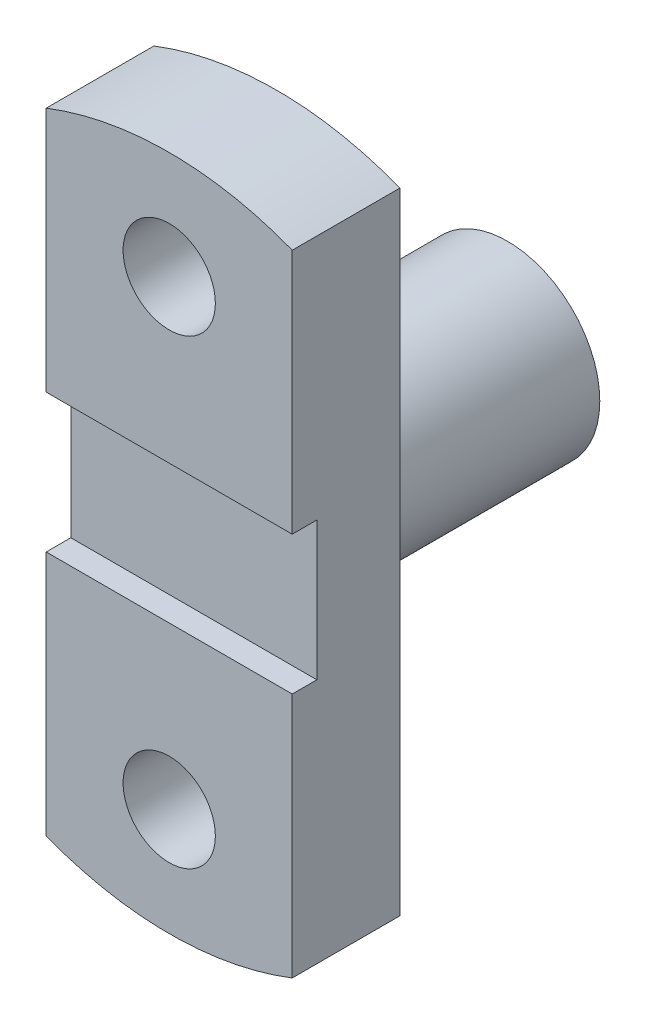
ISO-10303-21;
HEADER;
FILE_DESCRIPTION(('STEP AP214'),'2;1');
FILE_NAME('part.step','',(''),(''),'','','');
FILE_SCHEMA(('AUTOMOTIVE_DESIGN { 1 0 10303 214 1 1 1 1 }'));
ENDSEC;
DATA;
#1=APPLICATION_CONTEXT('core data for automotive mechanical design processes');
#2=APPLICATION_PROTOCOL_DEFINITION('international standard','automotive_design',2000,#1);
#3=PRODUCT_CONTEXT('',#1,'mechanical');
#4=PRODUCT('Part','Part','',(#3));
#5=PRODUCT_RELATED_PRODUCT_CATEGORY('part','',(#4));
#6=PRODUCT_DEFINITION_FORMATION('','',#4);
#7=PRODUCT_DEFINITION_CONTEXT('part definition',#1,'design');
#8=PRODUCT_DEFINITION('design','',#6,#7);
#9=PRODUCT_DEFINITION_SHAPE('','',#8);
#10=(LENGTH_UNIT() NAMED_UNIT(*) SI_UNIT(.MILLI.,.METRE.));
#11=(NAMED_UNIT(*) PLANE_ANGLE_UNIT() SI_UNIT($,.RADIAN.));
#12=(NAMED_UNIT(*) SI_UNIT($,.STERADIAN.) SOLID_ANGLE_UNIT());
#13=UNCERTAINTY_MEASURE_WITH_UNIT(LENGTH_MEASURE(1.E-05),#10,'distance_accuracy_value','');
#14=(GEOMETRIC_REPRESENTATION_CONTEXT(3) GLOBAL_UNCERTAINTY_ASSIGNED_CONTEXT((#13)) GLOBAL_UNIT_ASSIGNED_CONTEXT((#10,
#11,#12)) REPRESENTATION_CONTEXT('',''));
#15=CARTESIAN_POINT('',(0.,0.,0.));
#16=DIRECTION('',(0.,0.,1.));
#17=DIRECTION('',(1.,0.,0.));
#18=AXIS2_PLACEMENT_3D('',#15,#16,#17);
#19=CARTESIAN_POINT('',(0.,0.,110.));
#20=DIRECTION('',(0.,0.,1.));
#21=DIRECTION('',(1.,0.,0.));
#22=AXIS2_PLACEMENT_3D('',#19,#20,#21);
#23=PLANE('',#22);
#24=DIRECTION('',(1.,0.,0.));
#25=VECTOR('',#24,1.);
#26=CARTESIAN_POINT('',(-40.001,22.5,110.));
#27=LINE('',#26,#25);
#28=CARTESIAN_POINT('',(-40.,22.5,110.));
#29=VERTEX_POINT('',#28);
#30=CARTESIAN_POINT('',(40.,22.5,110.));
#31=VERTEX_POINT('',#30);
#32=EDGE_CURVE('E119',#29,#31,#27,.T.);
#33=ORIENTED_EDGE('',*,*,#32,.T.);
#34=DIRECTION('',(0.,1.,0.));
#35=VECTOR('',#34,1.);
#36=CARTESIAN_POINT('',(40.,-102.469507659596,110.));
#37=LINE('',#36,#35);
#38=CARTESIAN_POINT('',(40.,102.469507659596,110.));
#39=VERTEX_POINT('',#38);
#40=EDGE_CURVE('E202',#31,#39,#37,.T.);
#41=ORIENTED_EDGE('',*,*,#40,.T.);
#42=CARTESIAN_POINT('',(0.,0.,110.));
#43=DIRECTION('',(0.,0.,1.));
#44=DIRECTION('',(1.,0.,0.));
#45=AXIS2_PLACEMENT_3D('',#42,#43,#44);
#46=CIRCLE('',#45,110.);
#47=CARTESIAN_POINT('',(-40.,102.469507659596,110.));
#48=VERTEX_POINT('',#47);
#49=EDGE_CURVE('E129',#39,#48,#46,.T.);
#50=ORIENTED_EDGE('',*,*,#49,.T.);
#51=DIRECTION('',(0.,-1.,0.));
#52=VECTOR('',#51,1.);
#53=CARTESIAN_POINT('',(-40.,102.469507659596,110.));
#54=LINE('',#53,#52);
#55=EDGE_CURVE('E128',#48,#29,#54,.T.);
#56=ORIENTED_EDGE('',*,*,#55,.T.);
#57=EDGE_LOOP('',(#33,#41,#50,#56));
#58=FACE_BOUND('',#57,.T.);
#59=CARTESIAN_POINT('',(0.,75.,110.));
#60=DIRECTION('',(0.,0.,1.));
#61=DIRECTION('',(1.,0.,0.));
#62=AXIS2_PLACEMENT_3D('',#59,#60,#61);
#63=CIRCLE('',#62,15.);
#64=CARTESIAN_POINT('',(15.,75.,110.));
#65=VERTEX_POINT('',#64);
#66=EDGE_CURVE('E209',#65,#65,#63,.T.);
#67=ORIENTED_EDGE('',*,*,#66,.F.);
#68=EDGE_LOOP('',(#67));
#69=FACE_BOUND('',#68,.T.);
#70=ADVANCED_FACE('F37',(#58,#69),#23,.T.);
#71=CARTESIAN_POINT('',(0.,0.,75.));
#72=DIRECTION('',(0.,0.,-1.));
#73=DIRECTION('',(-1.,0.,0.));
#74=AXIS2_PLACEMENT_3D('',#71,#72,#73);
#75=CYLINDRICAL_SURFACE('',#74,30.);
#76=CARTESIAN_POINT('',(0.,0.,75.));
#77=DIRECTION('',(0.,0.,1.));
#78=DIRECTION('',(1.,0.,0.));
#79=AXIS2_PLACEMENT_3D('',#76,#77,#78);
#80=CIRCLE('',#79,30.);
#81=CARTESIAN_POINT('',(30.,0.,75.));
#82=VERTEX_POINT('',#81);
#83=EDGE_CURVE('E11',#82,#82,#80,.T.);
#84=ORIENTED_EDGE('',*,*,#83,.F.);
#85=EDGE_LOOP('',(#84));
#86=FACE_BOUND('',#85,.T.);
#87=CARTESIAN_POINT('',(0.,0.,0.));
#88=DIRECTION('',(0.,0.,1.));
#89=DIRECTION('',(1.,0.,0.));
#90=AXIS2_PLACEMENT_3D('',#87,#88,#89);
#91=CIRCLE('',#90,30.);
#92=CARTESIAN_POINT('',(30.,0.,0.));
#93=VERTEX_POINT('',#92);
#94=EDGE_CURVE('E41',#93,#93,#91,.T.);
#95=ORIENTED_EDGE('',*,*,#94,.T.);
#96=EDGE_LOOP('',(#95));
#97=FACE_BOUND('',#96,.T.);
#98=ADVANCED_FACE('F39',(#86,#97),#75,.T.);
#99=CARTESIAN_POINT('',(0.,0.,0.));
#100=DIRECTION('',(0.,0.,1.));
#101=DIRECTION('',(1.,0.,0.));
#102=AXIS2_PLACEMENT_3D('',#99,#100,#101);
#103=PLANE('',#102);
#104=ORIENTED_EDGE('',*,*,#94,.F.);
#105=EDGE_LOOP('',(#104));
#106=FACE_BOUND('',#105,.T.);
#107=ADVANCED_FACE('F157',(#106),#103,.F.);
#108=DIRECTION('',(1.,0.,0.));
#109=VECTOR('',#108,1.);
#110=CARTESIAN_POINT('',(-40.001,-22.5,110.));
#111=LINE('',#110,#109);
#112=CARTESIAN_POINT('',(-40.,-22.5,110.));
#113=VERTEX_POINT('',#112);
#114=CARTESIAN_POINT('',(40.,-22.5,110.));
#115=VERTEX_POINT('',#114);
#116=EDGE_CURVE('E116',#113,#115,#111,.T.);
#117=ORIENTED_EDGE('',*,*,#116,.F.);
#118=CARTESIAN_POINT('',(-40.,-102.469507659596,110.));
#119=VERTEX_POINT('',#118);
#120=EDGE_CURVE('E61',#113,#119,#54,.T.);
#121=ORIENTED_EDGE('',*,*,#120,.T.);
#122=CARTESIAN_POINT('',(0.,0.,110.));
#123=DIRECTION('',(0.,0.,1.));
#124=DIRECTION('',(1.,0.,0.));
#125=AXIS2_PLACEMENT_3D('',#122,#123,#124);
#126=CIRCLE('',#125,110.);
#127=CARTESIAN_POINT('',(40.,-102.469507659596,110.));
#128=VERTEX_POINT('',#127);
#129=EDGE_CURVE('E144',#119,#128,#126,.T.);
#130=ORIENTED_EDGE('',*,*,#129,.T.);
#131=EDGE_CURVE('E91',#128,#115,#37,.T.);
#132=ORIENTED_EDGE('',*,*,#131,.T.);
#133=EDGE_LOOP('',(#117,#121,#130,#132));
#134=FACE_BOUND('',#133,.T.);
#135=CARTESIAN_POINT('',(0.,-75.,110.));
#136=DIRECTION('',(0.,0.,1.));
#137=DIRECTION('',(1.,0.,0.));
#138=AXIS2_PLACEMENT_3D('',#135,#136,#137);
#139=CIRCLE('',#138,15.);
#140=CARTESIAN_POINT('',(15.,-75.,110.));
#141=VERTEX_POINT('',#140);
#142=EDGE_CURVE('E139',#141,#141,#139,.T.);
#143=ORIENTED_EDGE('',*,*,#142,.F.);
#144=EDGE_LOOP('',(#143));
#145=FACE_BOUND('',#144,.T.);
#146=ADVANCED_FACE('F121',(#134,#145),#23,.T.);
#147=CARTESIAN_POINT('',(0.,0.,75.));
#148=DIRECTION('',(0.,0.,1.));
#149=DIRECTION('',(1.,0.,0.));
#150=AXIS2_PLACEMENT_3D('',#147,#148,#149);
#151=PLANE('',#150);
#152=ORIENTED_EDGE('',*,*,#83,.T.);
#153=EDGE_LOOP('',(#152));
#154=FACE_BOUND('',#153,.T.);
#155=CARTESIAN_POINT('',(0.,0.,75.));
#156=DIRECTION('',(0.,0.,1.));
#157=DIRECTION('',(1.,0.,0.));
#158=AXIS2_PLACEMENT_3D('',#155,#156,#157);
#159=CIRCLE('',#158,110.);
#160=CARTESIAN_POINT('',(-40.,-102.469507659596,75.));
#161=VERTEX_POINT('',#160);
#162=CARTESIAN_POINT('',(40.,-102.469507659596,75.));
#163=VERTEX_POINT('',#162);
#164=EDGE_CURVE('E135',#161,#163,#159,.T.);
#165=ORIENTED_EDGE('',*,*,#164,.F.);
#166=DIRECTION('',(0.,-1.,0.));
#167=VECTOR('',#166,1.);
#168=CARTESIAN_POINT('',(-40.,102.469507659596,75.));
#169=LINE('',#168,#167);
#170=CARTESIAN_POINT('',(-40.,102.469507659596,75.));
#171=VERTEX_POINT('',#170);
#172=EDGE_CURVE('E83',#171,#161,#169,.T.);
#173=ORIENTED_EDGE('',*,*,#172,.F.);
#174=CARTESIAN_POINT('',(0.,0.,75.));
#175=DIRECTION('',(0.,0.,1.));
#176=DIRECTION('',(1.,0.,0.));
#177=AXIS2_PLACEMENT_3D('',#174,#175,#176);
#178=CIRCLE('',#177,110.);
#179=CARTESIAN_POINT('',(40.,102.469507659596,75.));
#180=VERTEX_POINT('',#179);
#181=EDGE_CURVE('E141',#180,#171,#178,.T.);
#182=ORIENTED_EDGE('',*,*,#181,.F.);
#183=DIRECTION('',(0.,1.,0.));
#184=VECTOR('',#183,1.);
#185=CARTESIAN_POINT('',(40.,-102.469507659596,75.));
#186=LINE('',#185,#184);
#187=EDGE_CURVE('E138',#163,#180,#186,.T.);
#188=ORIENTED_EDGE('',*,*,#187,.F.);
#189=EDGE_LOOP('',(#165,#173,#182,#188));
#190=FACE_BOUND('',#189,.T.);
#191=CARTESIAN_POINT('',(0.,-75.,75.));
#192=DIRECTION('',(0.,0.,1.));
#193=DIRECTION('',(1.,0.,0.));
#194=AXIS2_PLACEMENT_3D('',#191,#192,#193);
#195=CIRCLE('',#194,15.);
#196=CARTESIAN_POINT('',(15.,-75.,75.));
#197=VERTEX_POINT('',#196);
#198=EDGE_CURVE('E206',#197,#197,#195,.T.);
#199=ORIENTED_EDGE('',*,*,#198,.T.);
#200=EDGE_LOOP('',(#199));
#201=FACE_BOUND('',#200,.T.);
#202=CARTESIAN_POINT('',(0.,75.,75.));
#203=DIRECTION('',(0.,0.,1.));
#204=DIRECTION('',(1.,0.,0.));
#205=AXIS2_PLACEMENT_3D('',#202,#203,#204);
#206=CIRCLE('',#205,15.);
#207=CARTESIAN_POINT('',(15.,75.,75.));
#208=VERTEX_POINT('',#207);
#209=EDGE_CURVE('E118',#208,#208,#206,.T.);
#210=ORIENTED_EDGE('',*,*,#209,.T.);
#211=EDGE_LOOP('',(#210));
#212=FACE_BOUND('',#211,.T.);
#213=ADVANCED_FACE('F163',(#154,#190,#201,#212),#151,.F.);
#214=CARTESIAN_POINT('',(0.,0.,110.));
#215=DIRECTION('',(0.,0.,-1.));
#216=DIRECTION('',(-1.,0.,0.));
#217=AXIS2_PLACEMENT_3D('',#214,#215,#216);
#218=CYLINDRICAL_SURFACE('',#217,110.);
#219=ORIENTED_EDGE('',*,*,#164,.T.);
#220=DIRECTION('',(0.,0.,-1.));
#221=VECTOR('',#220,1.);
#222=CARTESIAN_POINT('',(40.,-102.469507659596,110.));
#223=LINE('',#222,#221);
#224=EDGE_CURVE('E151',#128,#163,#223,.T.);
#225=ORIENTED_EDGE('',*,*,#224,.F.);
#226=ORIENTED_EDGE('',*,*,#129,.F.);
#227=DIRECTION('',(0.,0.,-1.));
#228=VECTOR('',#227,1.);
#229=CARTESIAN_POINT('',(-40.,-102.469507659596,110.));
#230=LINE('',#229,#228);
#231=EDGE_CURVE('E126',#119,#161,#230,.T.);
#232=ORIENTED_EDGE('',*,*,#231,.T.);
#233=EDGE_LOOP('',(#219,#225,#226,#232));
#234=FACE_BOUND('',#233,.T.);
#235=ADVANCED_FACE('F179',(#234),#218,.T.);
#236=CARTESIAN_POINT('',(40.,-102.469507659596,110.));
#237=DIRECTION('',(-1.,0.,0.));
#238=DIRECTION('',(0.,0.,1.));
#239=AXIS2_PLACEMENT_3D('',#236,#237,#238);
#240=PLANE('',#239);
#241=ORIENTED_EDGE('',*,*,#40,.F.);
#242=DIRECTION('',(0.,0.,1.));
#243=VECTOR('',#242,1.);
#244=CARTESIAN_POINT('',(40.,22.5,110.));
#245=LINE('',#244,#243);
#246=CARTESIAN_POINT('',(40.,22.5,102.));
#247=VERTEX_POINT('',#246);
#248=EDGE_CURVE('E123',#247,#31,#245,.T.);
#249=ORIENTED_EDGE('',*,*,#248,.F.);
#250=DIRECTION('',(0.,1.,0.));
#251=VECTOR('',#250,1.);
#252=CARTESIAN_POINT('',(40.,22.5,102.));
#253=LINE('',#252,#251);
#254=CARTESIAN_POINT('',(40.,-22.5,102.));
#255=VERTEX_POINT('',#254);
#256=EDGE_CURVE('E221',#255,#247,#253,.T.);
#257=ORIENTED_EDGE('',*,*,#256,.F.);
#258=DIRECTION('',(0.,0.,-1.));
#259=VECTOR('',#258,1.);
#260=CARTESIAN_POINT('',(40.,-22.5,110.));
#261=LINE('',#260,#259);
#262=EDGE_CURVE('E224',#115,#255,#261,.T.);
#263=ORIENTED_EDGE('',*,*,#262,.F.);
#264=ORIENTED_EDGE('',*,*,#131,.F.);
#265=ORIENTED_EDGE('',*,*,#224,.T.);
#266=ORIENTED_EDGE('',*,*,#187,.T.);
#267=DIRECTION('',(0.,0.,-1.));
#268=VECTOR('',#267,1.);
#269=CARTESIAN_POINT('',(40.,102.469507659596,110.));
#270=LINE('',#269,#268);
#271=EDGE_CURVE('E148',#39,#180,#270,.T.);
#272=ORIENTED_EDGE('',*,*,#271,.F.);
#273=EDGE_LOOP('',(#241,#249,#257,#263,#264,#265,#266,#272));
#274=FACE_BOUND('',#273,.T.);
#275=ADVANCED_FACE('F186',(#274),#240,.F.);
#276=CARTESIAN_POINT('',(0.,0.,110.));
#277=DIRECTION('',(0.,0.,-1.));
#278=DIRECTION('',(-1.,0.,0.));
#279=AXIS2_PLACEMENT_3D('',#276,#277,#278);
#280=CYLINDRICAL_SURFACE('',#279,110.);
#281=ORIENTED_EDGE('',*,*,#181,.T.);
#282=DIRECTION('',(0.,0.,-1.));
#283=VECTOR('',#282,1.);
#284=CARTESIAN_POINT('',(-40.,102.469507659596,110.));
#285=LINE('',#284,#283);
#286=EDGE_CURVE('E146',#48,#171,#285,.T.);
#287=ORIENTED_EDGE('',*,*,#286,.F.);
#288=ORIENTED_EDGE('',*,*,#49,.F.);
#289=ORIENTED_EDGE('',*,*,#271,.T.);
#290=EDGE_LOOP('',(#281,#287,#288,#289));
#291=FACE_BOUND('',#290,.T.);
#292=ADVANCED_FACE('F183',(#291),#280,.T.);
#293=CARTESIAN_POINT('',(-40.,102.469507659596,110.));
#294=DIRECTION('',(1.,0.,0.));
#295=DIRECTION('',(0.,0.,-1.));
#296=AXIS2_PLACEMENT_3D('',#293,#294,#295);
#297=PLANE('',#296);
#298=DIRECTION('',(0.,-1.,0.));
#299=VECTOR('',#298,1.);
#300=CARTESIAN_POINT('',(-40.,22.5,102.));
#301=LINE('',#300,#299);
#302=CARTESIAN_POINT('',(-40.,22.5,102.));
#303=VERTEX_POINT('',#302);
#304=CARTESIAN_POINT('',(-40.,-22.5,102.));
#305=VERTEX_POINT('',#304);
#306=EDGE_CURVE('E52',#303,#305,#301,.T.);
#307=ORIENTED_EDGE('',*,*,#306,.F.);
#308=DIRECTION('',(0.,0.,-1.));
#309=VECTOR('',#308,1.);
#310=CARTESIAN_POINT('',(-40.,22.5,110.));
#311=LINE('',#310,#309);
#312=EDGE_CURVE('E226',#29,#303,#311,.T.);
#313=ORIENTED_EDGE('',*,*,#312,.F.);
#314=ORIENTED_EDGE('',*,*,#55,.F.);
#315=ORIENTED_EDGE('',*,*,#286,.T.);
#316=ORIENTED_EDGE('',*,*,#172,.T.);
#317=ORIENTED_EDGE('',*,*,#231,.F.);
#318=ORIENTED_EDGE('',*,*,#120,.F.);
#319=DIRECTION('',(0.,0.,1.));
#320=VECTOR('',#319,1.);
#321=CARTESIAN_POINT('',(-40.,-22.5,110.));
#322=LINE('',#321,#320);
#323=EDGE_CURVE('E113',#305,#113,#322,.T.);
#324=ORIENTED_EDGE('',*,*,#323,.F.);
#325=EDGE_LOOP('',(#307,#313,#314,#315,#316,#317,#318,#324));
#326=FACE_BOUND('',#325,.T.);
#327=ADVANCED_FACE('F125',(#326),#297,.F.);
#328=CARTESIAN_POINT('',(0.,-75.,110.));
#329=DIRECTION('',(0.,0.,-1.));
#330=DIRECTION('',(-1.,0.,0.));
#331=AXIS2_PLACEMENT_3D('',#328,#329,#330);
#332=CYLINDRICAL_SURFACE('',#331,15.);
#333=ORIENTED_EDGE('',*,*,#142,.T.);
#334=EDGE_LOOP('',(#333));
#335=FACE_BOUND('',#334,.T.);
#336=ORIENTED_EDGE('',*,*,#198,.F.);
#337=EDGE_LOOP('',(#336));
#338=FACE_BOUND('',#337,.T.);
#339=ADVANCED_FACE('F175',(#335,#338),#332,.F.);
#340=CARTESIAN_POINT('',(0.,75.,110.));
#341=DIRECTION('',(0.,0.,-1.));
#342=DIRECTION('',(-1.,0.,0.));
#343=AXIS2_PLACEMENT_3D('',#340,#341,#342);
#344=CYLINDRICAL_SURFACE('',#343,15.);
#345=ORIENTED_EDGE('',*,*,#66,.T.);
#346=EDGE_LOOP('',(#345));
#347=FACE_BOUND('',#346,.T.);
#348=ORIENTED_EDGE('',*,*,#209,.F.);
#349=EDGE_LOOP('',(#348));
#350=FACE_BOUND('',#349,.T.);
#351=ADVANCED_FACE('F241',(#347,#350),#344,.F.);
#352=CARTESIAN_POINT('',(-40.001,22.5,110.));
#353=DIRECTION('',(0.,1.,0.));
#354=DIRECTION('',(0.,0.,1.));
#355=AXIS2_PLACEMENT_3D('',#352,#353,#354);
#356=PLANE('',#355);
#357=ORIENTED_EDGE('',*,*,#312,.T.);
#358=DIRECTION('',(1.,0.,0.));
#359=VECTOR('',#358,1.);
#360=CARTESIAN_POINT('',(-40.001,22.5,102.));
#361=LINE('',#360,#359);
#362=EDGE_CURVE('E217',#303,#247,#361,.T.);
#363=ORIENTED_EDGE('',*,*,#362,.T.);
#364=ORIENTED_EDGE('',*,*,#248,.T.);
#365=ORIENTED_EDGE('',*,*,#32,.F.);
#366=EDGE_LOOP('',(#357,#363,#364,#365));
#367=FACE_BOUND('',#366,.T.);
#368=ADVANCED_FACE('F231',(#367),#356,.F.);
#369=CARTESIAN_POINT('',(-40.001,22.5,102.));
#370=DIRECTION('',(0.,0.,-1.));
#371=DIRECTION('',(-1.,0.,0.));
#372=AXIS2_PLACEMENT_3D('',#369,#370,#371);
#373=PLANE('',#372);
#374=ORIENTED_EDGE('',*,*,#306,.T.);
#375=DIRECTION('',(1.,0.,0.));
#376=VECTOR('',#375,1.);
#377=CARTESIAN_POINT('',(-40.001,-22.5,102.));
#378=LINE('',#377,#376);
#379=EDGE_CURVE('E117',#305,#255,#378,.T.);
#380=ORIENTED_EDGE('',*,*,#379,.T.);
#381=ORIENTED_EDGE('',*,*,#256,.T.);
#382=ORIENTED_EDGE('',*,*,#362,.F.);
#383=EDGE_LOOP('',(#374,#380,#381,#382));
#384=FACE_BOUND('',#383,.T.);
#385=ADVANCED_FACE('F233',(#384),#373,.F.);
#386=CARTESIAN_POINT('',(-40.001,-22.5,110.));
#387=DIRECTION('',(0.,-1.,0.));
#388=DIRECTION('',(0.,0.,-1.));
#389=AXIS2_PLACEMENT_3D('',#386,#387,#388);
#390=PLANE('',#389);
#391=ORIENTED_EDGE('',*,*,#323,.T.);
#392=ORIENTED_EDGE('',*,*,#116,.T.);
#393=ORIENTED_EDGE('',*,*,#262,.T.);
#394=ORIENTED_EDGE('',*,*,#379,.F.);
#395=EDGE_LOOP('',(#391,#392,#393,#394));
#396=FACE_BOUND('',#395,.T.);
#397=ADVANCED_FACE('F114',(#396),#390,.F.);
#398=CLOSED_SHELL('',(#70,#98,#107,#146,#213,#235,#275,#292,#327,#339,#351,#368,#385,#397));
#399=MANIFOLD_SOLID_BREP('B2',#398);
#400=ADVANCED_BREP_SHAPE_REPRESENTATION('',(#18,#399),#14);
#401=SHAPE_DEFINITION_REPRESENTATION(#9,#400);
ENDSEC;
END-ISO-10303-21;
